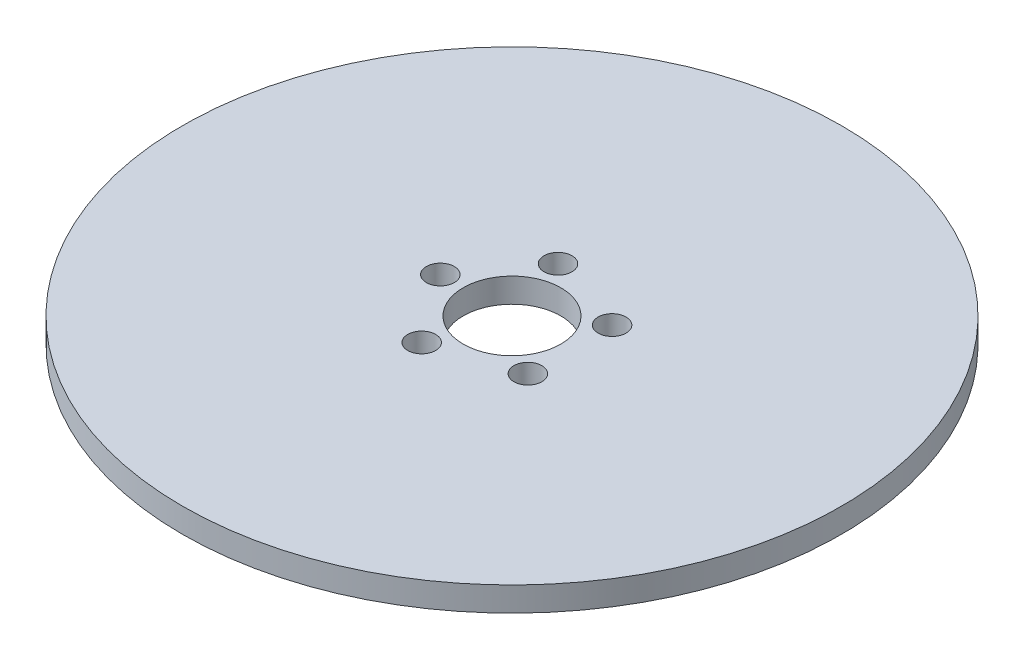
ISO-10303-21;
HEADER;
FILE_DESCRIPTION(('STEP AP214'),'2;1');
FILE_NAME('part.step','',(''),(''),'','','');
FILE_SCHEMA(('AUTOMOTIVE_DESIGN { 1 0 10303 214 1 1 1 1 }'));
ENDSEC;
DATA;
#1=APPLICATION_CONTEXT('core data for automotive mechanical design processes');
#2=APPLICATION_PROTOCOL_DEFINITION('international standard','automotive_design',2000,#1);
#3=PRODUCT_CONTEXT('',#1,'mechanical');
#4=PRODUCT('Part','Part','',(#3));
#5=PRODUCT_RELATED_PRODUCT_CATEGORY('part','',(#4));
#6=PRODUCT_DEFINITION_FORMATION('','',#4);
#7=PRODUCT_DEFINITION_CONTEXT('part definition',#1,'design');
#8=PRODUCT_DEFINITION('design','',#6,#7);
#9=PRODUCT_DEFINITION_SHAPE('','',#8);
#10=(LENGTH_UNIT() NAMED_UNIT(*) SI_UNIT(.MILLI.,.METRE.));
#11=(NAMED_UNIT(*) PLANE_ANGLE_UNIT() SI_UNIT($,.RADIAN.));
#12=(NAMED_UNIT(*) SI_UNIT($,.STERADIAN.) SOLID_ANGLE_UNIT());
#13=UNCERTAINTY_MEASURE_WITH_UNIT(LENGTH_MEASURE(1.E-05),#10,'distance_accuracy_value','');
#14=(GEOMETRIC_REPRESENTATION_CONTEXT(3) GLOBAL_UNCERTAINTY_ASSIGNED_CONTEXT((#13)) GLOBAL_UNIT_ASSIGNED_CONTEXT((#10,
#11,#12)) REPRESENTATION_CONTEXT('',''));
#15=CARTESIAN_POINT('',(0.,0.,0.));
#16=DIRECTION('',(0.,0.,1.));
#17=DIRECTION('',(1.,0.,0.));
#18=AXIS2_PLACEMENT_3D('',#15,#16,#17);
#19=CARTESIAN_POINT('',(0.,5.,0.));
#20=DIRECTION('',(0.,-1.,0.));
#21=DIRECTION('',(0.,0.,-1.));
#22=AXIS2_PLACEMENT_3D('',#19,#20,#21);
#23=CYLINDRICAL_SURFACE('',#22,67.5);
#24=CARTESIAN_POINT('',(0.,5.,0.));
#25=DIRECTION('',(0.,1.,0.));
#26=DIRECTION('',(0.,0.,1.));
#27=AXIS2_PLACEMENT_3D('',#24,#25,#26);
#28=CIRCLE('',#27,67.5);
#29=CARTESIAN_POINT('',(0.,5.,67.5));
#30=VERTEX_POINT('',#29);
#31=EDGE_CURVE('E10',#30,#30,#28,.T.);
#32=ORIENTED_EDGE('',*,*,#31,.F.);
#33=EDGE_LOOP('',(#32));
#34=FACE_BOUND('',#33,.T.);
#35=CARTESIAN_POINT('',(0.,0.,0.));
#36=DIRECTION('',(0.,1.,0.));
#37=DIRECTION('',(0.,0.,1.));
#38=AXIS2_PLACEMENT_3D('',#35,#36,#37);
#39=CIRCLE('',#38,67.5);
#40=CARTESIAN_POINT('',(0.,0.,67.5));
#41=VERTEX_POINT('',#40);
#42=EDGE_CURVE('E37',#41,#41,#39,.T.);
#43=ORIENTED_EDGE('',*,*,#42,.T.);
#44=EDGE_LOOP('',(#43));
#45=FACE_BOUND('',#44,.T.);
#46=ADVANCED_FACE('F40',(#34,#45),#23,.T.);
#47=CARTESIAN_POINT('',(0.,5.,0.));
#48=DIRECTION('',(0.,1.,0.));
#49=DIRECTION('',(0.,0.,1.));
#50=AXIS2_PLACEMENT_3D('',#47,#48,#49);
#51=PLANE('',#50);
#52=CARTESIAN_POINT('',(-4.53541346418557,5.,-13.9585673530064));
#53=DIRECTION('',(0.,1.,0.));
#54=DIRECTION('',(-0.95105651629515,0.,0.309016994374958));
#55=AXIS2_PLACEMENT_3D('',#52,#53,#54);
#56=CIRCLE('',#55,2.86150818455521);
#57=CARTESIAN_POINT('',(-7.25686946953871,5.,-13.0743126944358));
#58=VERTEX_POINT('',#57);
#59=EDGE_CURVE('E70',#58,#58,#56,.T.);
#60=ORIENTED_EDGE('',*,*,#59,.F.);
#61=EDGE_LOOP('',(#60));
#62=FACE_BOUND('',#61,.T.);
#63=CARTESIAN_POINT('',(11.8738666022712,5.,-8.62686905841273));
#64=DIRECTION('',(0.,1.,0.));
#65=DIRECTION('',(-0.58778525229248,0.,-0.809016994374942));
#66=AXIS2_PLACEMENT_3D('',#63,#64,#65);
#67=CIRCLE('',#66,2.86150818455521);
#68=CARTESIAN_POINT('',(10.1919142920755,5.,-10.9418778092609));
#69=VERTEX_POINT('',#68);
#70=EDGE_CURVE('E71',#69,#69,#67,.T.);
#71=ORIENTED_EDGE('',*,*,#70,.F.);
#72=EDGE_LOOP('',(#71));
#73=FACE_BOUND('',#72,.T.);
#74=CARTESIAN_POINT('',(11.8738666022714,5.,8.62686905841256));
#75=DIRECTION('',(0.,1.,0.));
#76=DIRECTION('',(0.587785252292469,0.,-0.809016994374951));
#77=AXIS2_PLACEMENT_3D('',#74,#75,#76);
#78=CIRCLE('',#77,2.86150818455521);
#79=CARTESIAN_POINT('',(13.5558189124671,5.,6.31186030756439));
#80=VERTEX_POINT('',#79);
#81=EDGE_CURVE('E78',#80,#80,#78,.T.);
#82=ORIENTED_EDGE('',*,*,#81,.F.);
#83=EDGE_LOOP('',(#82));
#84=FACE_BOUND('',#83,.T.);
#85=CARTESIAN_POINT('',(-4.53541346418538,5.,13.9585673530065));
#86=DIRECTION('',(0.,1.,0.));
#87=DIRECTION('',(0.951056516295155,0.,0.309016994374945));
#88=AXIS2_PLACEMENT_3D('',#85,#86,#87);
#89=CIRCLE('',#88,2.86150818455521);
#90=CARTESIAN_POINT('',(-1.81395745883223,5.,14.842822011577));
#91=VERTEX_POINT('',#90);
#92=EDGE_CURVE('E61',#91,#91,#89,.T.);
#93=ORIENTED_EDGE('',*,*,#92,.F.);
#94=EDGE_LOOP('',(#93));
#95=FACE_BOUND('',#94,.T.);
#96=CARTESIAN_POINT('',(-14.6769062761718,5.,0.));
#97=DIRECTION('',(0.,1.,0.));
#98=DIRECTION('',(0.,0.,1.));
#99=AXIS2_PLACEMENT_3D('',#96,#97,#98);
#100=CIRCLE('',#99,2.86150818455521);
#101=CARTESIAN_POINT('',(-14.6769062761718,5.,2.86150818455521));
#102=VERTEX_POINT('',#101);
#103=EDGE_CURVE('E54',#102,#102,#100,.T.);
#104=ORIENTED_EDGE('',*,*,#103,.F.);
#105=EDGE_LOOP('',(#104));
#106=FACE_BOUND('',#105,.T.);
#107=CARTESIAN_POINT('',(0.,5.,0.));
#108=DIRECTION('',(0.,1.,0.));
#109=DIRECTION('',(0.,0.,1.));
#110=AXIS2_PLACEMENT_3D('',#107,#108,#109);
#111=CIRCLE('',#110,10.);
#112=CARTESIAN_POINT('',(0.,5.,10.));
#113=VERTEX_POINT('',#112);
#114=EDGE_CURVE('E50',#113,#113,#111,.T.);
#115=ORIENTED_EDGE('',*,*,#114,.F.);
#116=EDGE_LOOP('',(#115));
#117=FACE_BOUND('',#116,.T.);
#118=ORIENTED_EDGE('',*,*,#31,.T.);
#119=EDGE_LOOP('',(#118));
#120=FACE_BOUND('',#119,.T.);
#121=ADVANCED_FACE('F94',(#62,#73,#84,#95,#106,#117,#120),#51,.T.);
#122=CARTESIAN_POINT('',(0.,0.,0.));
#123=DIRECTION('',(0.,1.,0.));
#124=DIRECTION('',(0.,0.,1.));
#125=AXIS2_PLACEMENT_3D('',#122,#123,#124);
#126=PLANE('',#125);
#127=CARTESIAN_POINT('',(0.,0.,0.));
#128=DIRECTION('',(0.,1.,0.));
#129=DIRECTION('',(0.,0.,1.));
#130=AXIS2_PLACEMENT_3D('',#127,#128,#129);
#131=CIRCLE('',#130,10.);
#132=CARTESIAN_POINT('',(0.,0.,10.));
#133=VERTEX_POINT('',#132);
#134=EDGE_CURVE('E47',#133,#133,#131,.T.);
#135=ORIENTED_EDGE('',*,*,#134,.T.);
#136=EDGE_LOOP('',(#135));
#137=FACE_BOUND('',#136,.T.);
#138=ORIENTED_EDGE('',*,*,#42,.F.);
#139=EDGE_LOOP('',(#138));
#140=FACE_BOUND('',#139,.T.);
#141=ADVANCED_FACE('F100',(#137,#140),#126,.F.);
#142=CARTESIAN_POINT('',(0.,5.,0.));
#143=DIRECTION('',(0.,-1.,0.));
#144=DIRECTION('',(0.,0.,-1.));
#145=AXIS2_PLACEMENT_3D('',#142,#143,#144);
#146=CYLINDRICAL_SURFACE('',#145,10.);
#147=ORIENTED_EDGE('',*,*,#114,.T.);
#148=EDGE_LOOP('',(#147));
#149=FACE_BOUND('',#148,.T.);
#150=ORIENTED_EDGE('',*,*,#134,.F.);
#151=EDGE_LOOP('',(#150));
#152=FACE_BOUND('',#151,.T.);
#153=ADVANCED_FACE('F106',(#149,#152),#146,.F.);
#154=CARTESIAN_POINT('',(-14.6769062761718,0.875245963640057,0.));
#155=DIRECTION('',(0.,1.,0.));
#156=DIRECTION('',(0.,0.,1.));
#157=AXIS2_PLACEMENT_3D('',#154,#155,#156);
#158=CYLINDRICAL_SURFACE('',#157,2.86150818455521);
#159=CARTESIAN_POINT('',(-14.6769062761718,0.875245963640057,0.));
#160=DIRECTION('',(0.,1.,0.));
#161=DIRECTION('',(0.,0.,1.));
#162=AXIS2_PLACEMENT_3D('',#159,#160,#161);
#163=CIRCLE('',#162,2.86150818455521);
#164=CARTESIAN_POINT('',(-14.6769062761718,0.875245963640057,2.86150818455521));
#165=VERTEX_POINT('',#164);
#166=EDGE_CURVE('E55',#165,#165,#163,.T.);
#167=ORIENTED_EDGE('',*,*,#166,.F.);
#168=EDGE_LOOP('',(#167));
#169=FACE_BOUND('',#168,.T.);
#170=ORIENTED_EDGE('',*,*,#103,.T.);
#171=EDGE_LOOP('',(#170));
#172=FACE_BOUND('',#171,.T.);
#173=ADVANCED_FACE('F108',(#169,#172),#158,.F.);
#174=CARTESIAN_POINT('',(-14.6769062761718,0.875245963640057,0.));
#175=DIRECTION('',(0.,1.,0.));
#176=DIRECTION('',(0.,0.,1.));
#177=AXIS2_PLACEMENT_3D('',#174,#175,#176);
#178=PLANE('',#177);
#179=ORIENTED_EDGE('',*,*,#166,.T.);
#180=EDGE_LOOP('',(#179));
#181=FACE_BOUND('',#180,.T.);
#182=ADVANCED_FACE('F138',(#181),#178,.T.);
#183=CARTESIAN_POINT('',(-4.53541346418538,0.875245963640057,13.9585673530065));
#184=DIRECTION('',(0.,1.,0.));
#185=DIRECTION('',(0.,0.,1.));
#186=AXIS2_PLACEMENT_3D('',#183,#184,#185);
#187=CYLINDRICAL_SURFACE('',#186,2.86150818455521);
#188=CARTESIAN_POINT('',(-4.53541346418538,0.875245963640057,13.9585673530065));
#189=DIRECTION('',(0.,1.,0.));
#190=DIRECTION('',(0.951056516295155,0.,0.309016994374945));
#191=AXIS2_PLACEMENT_3D('',#188,#189,#190);
#192=CIRCLE('',#191,2.86150818455521);
#193=CARTESIAN_POINT('',(-1.81395745883223,0.875245963640057,14.842822011577));
#194=VERTEX_POINT('',#193);
#195=EDGE_CURVE('E59',#194,#194,#192,.T.);
#196=ORIENTED_EDGE('',*,*,#195,.F.);
#197=EDGE_LOOP('',(#196));
#198=FACE_BOUND('',#197,.T.);
#199=ORIENTED_EDGE('',*,*,#92,.T.);
#200=EDGE_LOOP('',(#199));
#201=FACE_BOUND('',#200,.T.);
#202=ADVANCED_FACE('F150',(#198,#201),#187,.F.);
#203=CARTESIAN_POINT('',(-4.53541346418538,0.875245963640057,13.9585673530065));
#204=DIRECTION('',(0.,1.,0.));
#205=DIRECTION('',(0.951056516295155,0.,0.309016994374945));
#206=AXIS2_PLACEMENT_3D('',#203,#204,#205);
#207=PLANE('',#206);
#208=ORIENTED_EDGE('',*,*,#195,.T.);
#209=EDGE_LOOP('',(#208));
#210=FACE_BOUND('',#209,.T.);
#211=ADVANCED_FACE('F89',(#210),#207,.T.);
#212=CARTESIAN_POINT('',(11.8738666022714,0.875245963640057,8.62686905841256));
#213=DIRECTION('',(0.,1.,0.));
#214=DIRECTION('',(0.,0.,1.));
#215=AXIS2_PLACEMENT_3D('',#212,#213,#214);
#216=CYLINDRICAL_SURFACE('',#215,2.86150818455521);
#217=CARTESIAN_POINT('',(11.8738666022714,0.875245963640057,8.62686905841256));
#218=DIRECTION('',(0.,1.,0.));
#219=DIRECTION('',(0.587785252292469,0.,-0.809016994374951));
#220=AXIS2_PLACEMENT_3D('',#217,#218,#219);
#221=CIRCLE('',#220,2.86150818455521);
#222=CARTESIAN_POINT('',(13.5558189124671,0.875245963640057,6.31186030756439));
#223=VERTEX_POINT('',#222);
#224=EDGE_CURVE('E63',#223,#223,#221,.T.);
#225=ORIENTED_EDGE('',*,*,#224,.F.);
#226=EDGE_LOOP('',(#225));
#227=FACE_BOUND('',#226,.T.);
#228=ORIENTED_EDGE('',*,*,#81,.T.);
#229=EDGE_LOOP('',(#228));
#230=FACE_BOUND('',#229,.T.);
#231=ADVANCED_FACE('F87',(#227,#230),#216,.F.);
#232=CARTESIAN_POINT('',(11.8738666022714,0.875245963640057,8.62686905841256));
#233=DIRECTION('',(0.,1.,0.));
#234=DIRECTION('',(0.587785252292469,0.,-0.809016994374951));
#235=AXIS2_PLACEMENT_3D('',#232,#233,#234);
#236=PLANE('',#235);
#237=ORIENTED_EDGE('',*,*,#224,.T.);
#238=EDGE_LOOP('',(#237));
#239=FACE_BOUND('',#238,.T.);
#240=ADVANCED_FACE('F84',(#239),#236,.T.);
#241=CARTESIAN_POINT('',(11.8738666022712,0.875245963640057,-8.62686905841273));
#242=DIRECTION('',(0.,1.,0.));
#243=DIRECTION('',(0.,0.,1.));
#244=AXIS2_PLACEMENT_3D('',#241,#242,#243);
#245=CYLINDRICAL_SURFACE('',#244,2.86150818455521);
#246=CARTESIAN_POINT('',(11.8738666022712,0.875245963640057,-8.62686905841273));
#247=DIRECTION('',(0.,1.,0.));
#248=DIRECTION('',(-0.58778525229248,0.,-0.809016994374942));
#249=AXIS2_PLACEMENT_3D('',#246,#247,#248);
#250=CIRCLE('',#249,2.86150818455521);
#251=CARTESIAN_POINT('',(10.1919142920755,0.875245963640057,-10.9418778092609));
#252=VERTEX_POINT('',#251);
#253=EDGE_CURVE('E76',#252,#252,#250,.T.);
#254=ORIENTED_EDGE('',*,*,#253,.F.);
#255=EDGE_LOOP('',(#254));
#256=FACE_BOUND('',#255,.T.);
#257=ORIENTED_EDGE('',*,*,#70,.T.);
#258=EDGE_LOOP('',(#257));
#259=FACE_BOUND('',#258,.T.);
#260=ADVANCED_FACE('F185',(#256,#259),#245,.F.);
#261=CARTESIAN_POINT('',(11.8738666022712,0.875245963640057,-8.62686905841273));
#262=DIRECTION('',(0.,1.,0.));
#263=DIRECTION('',(-0.58778525229248,0.,-0.809016994374942));
#264=AXIS2_PLACEMENT_3D('',#261,#262,#263);
#265=PLANE('',#264);
#266=ORIENTED_EDGE('',*,*,#253,.T.);
#267=EDGE_LOOP('',(#266));
#268=FACE_BOUND('',#267,.T.);
#269=ADVANCED_FACE('F189',(#268),#265,.T.);
#270=CARTESIAN_POINT('',(-4.53541346418557,0.875245963640057,-13.9585673530064));
#271=DIRECTION('',(0.,1.,0.));
#272=DIRECTION('',(0.,0.,1.));
#273=AXIS2_PLACEMENT_3D('',#270,#271,#272);
#274=CYLINDRICAL_SURFACE('',#273,2.86150818455521);
#275=CARTESIAN_POINT('',(-4.53541346418557,0.875245963640057,-13.9585673530064));
#276=DIRECTION('',(0.,1.,0.));
#277=DIRECTION('',(-0.95105651629515,0.,0.309016994374958));
#278=AXIS2_PLACEMENT_3D('',#275,#276,#277);
#279=CIRCLE('',#278,2.86150818455521);
#280=CARTESIAN_POINT('',(-7.25686946953871,0.875245963640057,-13.0743126944358));
#281=VERTEX_POINT('',#280);
#282=EDGE_CURVE('E69',#281,#281,#279,.T.);
#283=ORIENTED_EDGE('',*,*,#282,.F.);
#284=EDGE_LOOP('',(#283));
#285=FACE_BOUND('',#284,.T.);
#286=ORIENTED_EDGE('',*,*,#59,.T.);
#287=EDGE_LOOP('',(#286));
#288=FACE_BOUND('',#287,.T.);
#289=ADVANCED_FACE('F200',(#285,#288),#274,.F.);
#290=CARTESIAN_POINT('',(-4.53541346418557,0.875245963640057,-13.9585673530064));
#291=DIRECTION('',(0.,1.,0.));
#292=DIRECTION('',(-0.95105651629515,0.,0.309016994374958));
#293=AXIS2_PLACEMENT_3D('',#290,#291,#292);
#294=PLANE('',#293);
#295=ORIENTED_EDGE('',*,*,#282,.T.);
#296=EDGE_LOOP('',(#295));
#297=FACE_BOUND('',#296,.T.);
#298=ADVANCED_FACE('F208',(#297),#294,.T.);
#299=CLOSED_SHELL('',(#46,#121,#141,#153,#173,#182,#202,#211,#231,#240,#260,#269,#289,#298));
#300=MANIFOLD_SOLID_BREP('B2',#299);
#301=ADVANCED_BREP_SHAPE_REPRESENTATION('',(#18,#300),#14);
#302=SHAPE_DEFINITION_REPRESENTATION(#9,#301);
ENDSEC;
END-ISO-10303-21;
